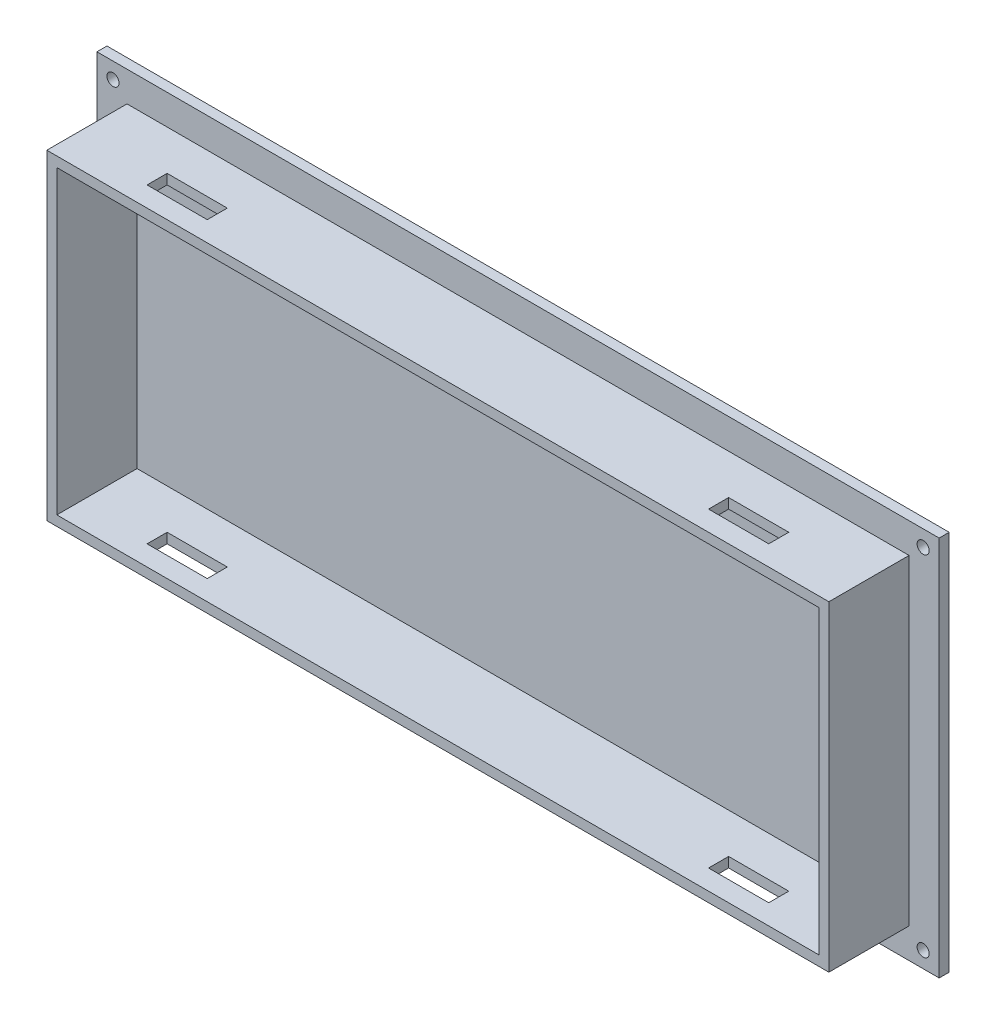
ISO-10303-21;
HEADER;
FILE_DESCRIPTION(('STEP AP214'),'2;1');
FILE_NAME('part.step','',(''),(''),'','','');
FILE_SCHEMA(('AUTOMOTIVE_DESIGN { 1 0 10303 214 1 1 1 1 }'));
ENDSEC;
DATA;
#1=APPLICATION_CONTEXT('core data for automotive mechanical design processes');
#2=APPLICATION_PROTOCOL_DEFINITION('international standard','automotive_design',2000,#1);
#3=PRODUCT_CONTEXT('',#1,'mechanical');
#4=PRODUCT('Part','Part','',(#3));
#5=PRODUCT_RELATED_PRODUCT_CATEGORY('part','',(#4));
#6=PRODUCT_DEFINITION_FORMATION('','',#4);
#7=PRODUCT_DEFINITION_CONTEXT('part definition',#1,'design');
#8=PRODUCT_DEFINITION('design','',#6,#7);
#9=PRODUCT_DEFINITION_SHAPE('','',#8);
#10=(LENGTH_UNIT() NAMED_UNIT(*) SI_UNIT(.MILLI.,.METRE.));
#11=(NAMED_UNIT(*) PLANE_ANGLE_UNIT() SI_UNIT($,.RADIAN.));
#12=(NAMED_UNIT(*) SI_UNIT($,.STERADIAN.) SOLID_ANGLE_UNIT());
#13=UNCERTAINTY_MEASURE_WITH_UNIT(LENGTH_MEASURE(1.E-05),#10,'distance_accuracy_value','');
#14=(GEOMETRIC_REPRESENTATION_CONTEXT(3) GLOBAL_UNCERTAINTY_ASSIGNED_CONTEXT((#13)) GLOBAL_UNIT_ASSIGNED_CONTEXT((#10,
#11,#12)) REPRESENTATION_CONTEXT('',''));
#15=CARTESIAN_POINT('',(0.,0.,0.));
#16=DIRECTION('',(0.,0.,1.));
#17=DIRECTION('',(1.,0.,0.));
#18=AXIS2_PLACEMENT_3D('',#15,#16,#17);
#19=CARTESIAN_POINT('',(0.,0.,2.5));
#20=DIRECTION('',(0.,0.,-1.));
#21=DIRECTION('',(-1.,0.,0.));
#22=AXIS2_PLACEMENT_3D('',#19,#20,#21);
#23=PLANE('',#22);
#24=CARTESIAN_POINT('',(4.,4.,2.5));
#25=DIRECTION('',(0.,0.,1.));
#26=DIRECTION('',(1.,0.,0.));
#27=AXIS2_PLACEMENT_3D('',#24,#25,#26);
#28=CIRCLE('',#27,1.5);
#29=CARTESIAN_POINT('',(5.5,4.,2.5));
#30=VERTEX_POINT('',#29);
#31=EDGE_CURVE('E820',#30,#30,#28,.T.);
#32=ORIENTED_EDGE('',*,*,#31,.F.);
#33=EDGE_LOOP('',(#32));
#34=FACE_BOUND('',#33,.T.);
#35=CARTESIAN_POINT('',(206.,4.,2.5));
#36=DIRECTION('',(0.,0.,1.));
#37=DIRECTION('',(1.,0.,0.));
#38=AXIS2_PLACEMENT_3D('',#35,#36,#37);
#39=CIRCLE('',#38,1.5);
#40=CARTESIAN_POINT('',(207.5,4.,2.5));
#41=VERTEX_POINT('',#40);
#42=EDGE_CURVE('E824',#41,#41,#39,.T.);
#43=ORIENTED_EDGE('',*,*,#42,.F.);
#44=EDGE_LOOP('',(#43));
#45=FACE_BOUND('',#44,.T.);
#46=CARTESIAN_POINT('',(206.,91.,2.5));
#47=DIRECTION('',(0.,0.,1.));
#48=DIRECTION('',(1.,0.,0.));
#49=AXIS2_PLACEMENT_3D('',#46,#47,#48);
#50=CIRCLE('',#49,1.5);
#51=CARTESIAN_POINT('',(207.5,91.,2.5));
#52=VERTEX_POINT('',#51);
#53=EDGE_CURVE('E843',#52,#52,#50,.T.);
#54=ORIENTED_EDGE('',*,*,#53,.F.);
#55=EDGE_LOOP('',(#54));
#56=FACE_BOUND('',#55,.T.);
#57=CARTESIAN_POINT('',(4.,91.,2.5));
#58=DIRECTION('',(0.,0.,1.));
#59=DIRECTION('',(1.,0.,0.));
#60=AXIS2_PLACEMENT_3D('',#57,#58,#59);
#61=CIRCLE('',#60,1.5);
#62=CARTESIAN_POINT('',(5.50000000000001,91.,2.5));
#63=VERTEX_POINT('',#62);
#64=EDGE_CURVE('E832',#63,#63,#61,.T.);
#65=ORIENTED_EDGE('',*,*,#64,.F.);
#66=EDGE_LOOP('',(#65));
#67=FACE_BOUND('',#66,.T.);
#68=DIRECTION('',(0.,-1.,0.));
#69=VECTOR('',#68,1.);
#70=CARTESIAN_POINT('',(0.,0.,2.5));
#71=LINE('',#70,#69);
#72=CARTESIAN_POINT('',(0.,95.,2.5));
#73=VERTEX_POINT('',#72);
#74=CARTESIAN_POINT('',(0.,0.,2.5));
#75=VERTEX_POINT('',#74);
#76=EDGE_CURVE('E381',#73,#75,#71,.T.);
#77=ORIENTED_EDGE('',*,*,#76,.T.);
#78=DIRECTION('',(1.,0.,0.));
#79=VECTOR('',#78,1.);
#80=CARTESIAN_POINT('',(0.,0.,2.5));
#81=LINE('',#80,#79);
#82=CARTESIAN_POINT('',(210.,0.,2.5));
#83=VERTEX_POINT('',#82);
#84=EDGE_CURVE('E384',#75,#83,#81,.T.);
#85=ORIENTED_EDGE('',*,*,#84,.T.);
#86=DIRECTION('',(0.,1.,0.));
#87=VECTOR('',#86,1.);
#88=CARTESIAN_POINT('',(210.,0.,2.5));
#89=LINE('',#88,#87);
#90=CARTESIAN_POINT('',(210.,95.,2.5));
#91=VERTEX_POINT('',#90);
#92=EDGE_CURVE('E387',#83,#91,#89,.T.);
#93=ORIENTED_EDGE('',*,*,#92,.T.);
#94=DIRECTION('',(-1.,0.,0.));
#95=VECTOR('',#94,1.);
#96=CARTESIAN_POINT('',(0.,95.,2.5));
#97=LINE('',#96,#95);
#98=EDGE_CURVE('E389',#91,#73,#97,.T.);
#99=ORIENTED_EDGE('',*,*,#98,.T.);
#100=EDGE_LOOP('',(#77,#85,#93,#99));
#101=FACE_BOUND('',#100,.T.);
#102=DIRECTION('',(0.,-1.,0.));
#103=VECTOR('',#102,1.);
#104=CARTESIAN_POINT('',(7.5,87.5,2.5));
#105=LINE('',#104,#103);
#106=CARTESIAN_POINT('',(7.5,87.5,2.5));
#107=VERTEX_POINT('',#106);
#108=CARTESIAN_POINT('',(7.50000000000001,7.5,2.5));
#109=VERTEX_POINT('',#108);
#110=EDGE_CURVE('E341',#107,#109,#105,.T.);
#111=ORIENTED_EDGE('',*,*,#110,.F.);
#112=DIRECTION('',(-1.,0.,0.));
#113=VECTOR('',#112,1.);
#114=CARTESIAN_POINT('',(7.5,87.5,2.5));
#115=LINE('',#114,#113);
#116=CARTESIAN_POINT('',(202.5,87.5,2.5));
#117=VERTEX_POINT('',#116);
#118=EDGE_CURVE('E352',#117,#107,#115,.T.);
#119=ORIENTED_EDGE('',*,*,#118,.F.);
#120=DIRECTION('',(0.,1.,0.));
#121=VECTOR('',#120,1.);
#122=CARTESIAN_POINT('',(202.5,87.5,2.5));
#123=LINE('',#122,#121);
#124=CARTESIAN_POINT('',(202.5,7.50000000000001,2.5));
#125=VERTEX_POINT('',#124);
#126=EDGE_CURVE('E364',#125,#117,#123,.T.);
#127=ORIENTED_EDGE('',*,*,#126,.F.);
#128=DIRECTION('',(1.,0.,0.));
#129=VECTOR('',#128,1.);
#130=CARTESIAN_POINT('',(7.50000000000001,7.5,2.5));
#131=LINE('',#130,#129);
#132=EDGE_CURVE('E361',#109,#125,#131,.T.);
#133=ORIENTED_EDGE('',*,*,#132,.F.);
#134=EDGE_LOOP('',(#111,#119,#127,#133));
#135=FACE_BOUND('',#134,.T.);
#136=ADVANCED_FACE('F32',(#34,#45,#56,#67,#101,#135),#23,.F.);
#137=CARTESIAN_POINT('',(0.,0.,2.5));
#138=DIRECTION('',(1.,0.,0.));
#139=DIRECTION('',(0.,0.,-1.));
#140=AXIS2_PLACEMENT_3D('',#137,#138,#139);
#141=PLANE('',#140);
#142=DIRECTION('',(0.,-1.,0.));
#143=VECTOR('',#142,1.);
#144=CARTESIAN_POINT('',(0.,0.,0.));
#145=LINE('',#144,#143);
#146=CARTESIAN_POINT('',(0.,95.,0.));
#147=VERTEX_POINT('',#146);
#148=CARTESIAN_POINT('',(0.,0.,0.));
#149=VERTEX_POINT('',#148);
#150=EDGE_CURVE('E380',#147,#149,#145,.T.);
#151=ORIENTED_EDGE('',*,*,#150,.T.);
#152=DIRECTION('',(0.,0.,-1.));
#153=VECTOR('',#152,1.);
#154=CARTESIAN_POINT('',(0.,0.,2.5));
#155=LINE('',#154,#153);
#156=EDGE_CURVE('E407',#75,#149,#155,.T.);
#157=ORIENTED_EDGE('',*,*,#156,.F.);
#158=ORIENTED_EDGE('',*,*,#76,.F.);
#159=DIRECTION('',(0.,0.,-1.));
#160=VECTOR('',#159,1.);
#161=CARTESIAN_POINT('',(0.,95.,2.5));
#162=LINE('',#161,#160);
#163=EDGE_CURVE('E391',#73,#147,#162,.T.);
#164=ORIENTED_EDGE('',*,*,#163,.T.);
#165=EDGE_LOOP('',(#151,#157,#158,#164));
#166=FACE_BOUND('',#165,.T.);
#167=ADVANCED_FACE('F34',(#166),#141,.F.);
#168=CARTESIAN_POINT('',(0.,0.,2.5));
#169=DIRECTION('',(0.,1.,0.));
#170=DIRECTION('',(0.,0.,1.));
#171=AXIS2_PLACEMENT_3D('',#168,#169,#170);
#172=PLANE('',#171);
#173=DIRECTION('',(1.,0.,0.));
#174=VECTOR('',#173,1.);
#175=CARTESIAN_POINT('',(0.,0.,0.));
#176=LINE('',#175,#174);
#177=CARTESIAN_POINT('',(210.,0.,0.));
#178=VERTEX_POINT('',#177);
#179=EDGE_CURVE('E394',#149,#178,#176,.T.);
#180=ORIENTED_EDGE('',*,*,#179,.T.);
#181=DIRECTION('',(0.,0.,-1.));
#182=VECTOR('',#181,1.);
#183=CARTESIAN_POINT('',(210.,0.,2.5));
#184=LINE('',#183,#182);
#185=EDGE_CURVE('E404',#83,#178,#184,.T.);
#186=ORIENTED_EDGE('',*,*,#185,.F.);
#187=ORIENTED_EDGE('',*,*,#84,.F.);
#188=ORIENTED_EDGE('',*,*,#156,.T.);
#189=EDGE_LOOP('',(#180,#186,#187,#188));
#190=FACE_BOUND('',#189,.T.);
#191=ADVANCED_FACE('F488',(#190),#172,.F.);
#192=CARTESIAN_POINT('',(210.,0.,2.5));
#193=DIRECTION('',(-1.,0.,0.));
#194=DIRECTION('',(0.,0.,1.));
#195=AXIS2_PLACEMENT_3D('',#192,#193,#194);
#196=PLANE('',#195);
#197=DIRECTION('',(0.,1.,0.));
#198=VECTOR('',#197,1.);
#199=CARTESIAN_POINT('',(210.,0.,0.));
#200=LINE('',#199,#198);
#201=CARTESIAN_POINT('',(210.,95.,0.));
#202=VERTEX_POINT('',#201);
#203=EDGE_CURVE('E396',#178,#202,#200,.T.);
#204=ORIENTED_EDGE('',*,*,#203,.T.);
#205=DIRECTION('',(0.,0.,-1.));
#206=VECTOR('',#205,1.);
#207=CARTESIAN_POINT('',(210.,95.,2.5));
#208=LINE('',#207,#206);
#209=EDGE_CURVE('E401',#91,#202,#208,.T.);
#210=ORIENTED_EDGE('',*,*,#209,.F.);
#211=ORIENTED_EDGE('',*,*,#92,.F.);
#212=ORIENTED_EDGE('',*,*,#185,.T.);
#213=EDGE_LOOP('',(#204,#210,#211,#212));
#214=FACE_BOUND('',#213,.T.);
#215=ADVANCED_FACE('F503',(#214),#196,.F.);
#216=CARTESIAN_POINT('',(0.,95.,2.5));
#217=DIRECTION('',(0.,-1.,0.));
#218=DIRECTION('',(0.,0.,-1.));
#219=AXIS2_PLACEMENT_3D('',#216,#217,#218);
#220=PLANE('',#219);
#221=DIRECTION('',(-1.,0.,0.));
#222=VECTOR('',#221,1.);
#223=CARTESIAN_POINT('',(0.,95.,0.));
#224=LINE('',#223,#222);
#225=EDGE_CURVE('E385',#202,#147,#224,.T.);
#226=ORIENTED_EDGE('',*,*,#225,.T.);
#227=ORIENTED_EDGE('',*,*,#163,.F.);
#228=ORIENTED_EDGE('',*,*,#98,.F.);
#229=ORIENTED_EDGE('',*,*,#209,.T.);
#230=EDGE_LOOP('',(#226,#227,#228,#229));
#231=FACE_BOUND('',#230,.T.);
#232=ADVANCED_FACE('F499',(#231),#220,.F.);
#233=CARTESIAN_POINT('',(0.,0.,0.));
#234=DIRECTION('',(0.,0.,-1.));
#235=DIRECTION('',(-1.,0.,0.));
#236=AXIS2_PLACEMENT_3D('',#233,#234,#235);
#237=PLANE('',#236);
#238=CARTESIAN_POINT('',(4.,4.,0.));
#239=DIRECTION('',(0.,0.,-1.));
#240=DIRECTION('',(-1.,0.,0.));
#241=AXIS2_PLACEMENT_3D('',#238,#239,#240);
#242=CIRCLE('',#241,1.5);
#243=CARTESIAN_POINT('',(2.5,4.,0.));
#244=VERTEX_POINT('',#243);
#245=EDGE_CURVE('E823',#244,#244,#242,.F.);
#246=ORIENTED_EDGE('',*,*,#245,.T.);
#247=EDGE_LOOP('',(#246));
#248=FACE_BOUND('',#247,.T.);
#249=CARTESIAN_POINT('',(206.,4.,0.));
#250=DIRECTION('',(0.,0.,-1.));
#251=DIRECTION('',(-1.,0.,0.));
#252=AXIS2_PLACEMENT_3D('',#249,#250,#251);
#253=CIRCLE('',#252,1.5);
#254=CARTESIAN_POINT('',(204.5,4.,0.));
#255=VERTEX_POINT('',#254);
#256=EDGE_CURVE('E827',#255,#255,#253,.F.);
#257=ORIENTED_EDGE('',*,*,#256,.T.);
#258=EDGE_LOOP('',(#257));
#259=FACE_BOUND('',#258,.T.);
#260=CARTESIAN_POINT('',(206.,91.,0.));
#261=DIRECTION('',(0.,0.,-1.));
#262=DIRECTION('',(-1.,0.,0.));
#263=AXIS2_PLACEMENT_3D('',#260,#261,#262);
#264=CIRCLE('',#263,1.5);
#265=CARTESIAN_POINT('',(204.5,91.,0.));
#266=VERTEX_POINT('',#265);
#267=EDGE_CURVE('E835',#266,#266,#264,.F.);
#268=ORIENTED_EDGE('',*,*,#267,.T.);
#269=EDGE_LOOP('',(#268));
#270=FACE_BOUND('',#269,.T.);
#271=CARTESIAN_POINT('',(4.,91.,0.));
#272=DIRECTION('',(0.,0.,-1.));
#273=DIRECTION('',(-1.,0.,0.));
#274=AXIS2_PLACEMENT_3D('',#271,#272,#273);
#275=CIRCLE('',#274,1.5);
#276=CARTESIAN_POINT('',(2.5,91.,0.));
#277=VERTEX_POINT('',#276);
#278=EDGE_CURVE('E273',#277,#277,#275,.F.);
#279=ORIENTED_EDGE('',*,*,#278,.T.);
#280=EDGE_LOOP('',(#279));
#281=FACE_BOUND('',#280,.T.);
#282=ORIENTED_EDGE('',*,*,#150,.F.);
#283=ORIENTED_EDGE('',*,*,#225,.F.);
#284=ORIENTED_EDGE('',*,*,#203,.F.);
#285=ORIENTED_EDGE('',*,*,#179,.F.);
#286=EDGE_LOOP('',(#282,#283,#284,#285));
#287=FACE_BOUND('',#286,.T.);
#288=ADVANCED_FACE('F496',(#248,#259,#270,#281,#287),#237,.T.);
#289=CARTESIAN_POINT('',(7.5,87.5,22.5));
#290=DIRECTION('',(1.,0.,0.));
#291=DIRECTION('',(0.,1.,0.));
#292=AXIS2_PLACEMENT_3D('',#289,#290,#291);
#293=PLANE('',#292);
#294=ORIENTED_EDGE('',*,*,#110,.T.);
#295=DIRECTION('',(0.,0.,-1.));
#296=VECTOR('',#295,1.);
#297=CARTESIAN_POINT('',(7.50000000000001,7.5,22.5));
#298=LINE('',#297,#296);
#299=CARTESIAN_POINT('',(7.50000000000001,7.5,22.5));
#300=VERTEX_POINT('',#299);
#301=EDGE_CURVE('E377',#300,#109,#298,.T.);
#302=ORIENTED_EDGE('',*,*,#301,.F.);
#303=DIRECTION('',(0.,-1.,0.));
#304=VECTOR('',#303,1.);
#305=CARTESIAN_POINT('',(7.5,87.5,22.5));
#306=LINE('',#305,#304);
#307=CARTESIAN_POINT('',(7.5,87.5,22.5));
#308=VERTEX_POINT('',#307);
#309=EDGE_CURVE('E348',#308,#300,#306,.T.);
#310=ORIENTED_EDGE('',*,*,#309,.F.);
#311=DIRECTION('',(0.,0.,-1.));
#312=VECTOR('',#311,1.);
#313=CARTESIAN_POINT('',(7.5,87.5,22.5));
#314=LINE('',#313,#312);
#315=EDGE_CURVE('E358',#308,#107,#314,.T.);
#316=ORIENTED_EDGE('',*,*,#315,.T.);
#317=EDGE_LOOP('',(#294,#302,#310,#316));
#318=FACE_BOUND('',#317,.T.);
#319=ADVANCED_FACE('F494',(#318),#293,.F.);
#320=CARTESIAN_POINT('',(7.50000000000001,7.5,22.5));
#321=DIRECTION('',(0.,1.,0.));
#322=DIRECTION('',(-1.,0.,0.));
#323=AXIS2_PLACEMENT_3D('',#320,#321,#322);
#324=PLANE('',#323);
#325=DIRECTION('',(-1.,0.,0.));
#326=VECTOR('',#325,1.);
#327=CARTESIAN_POINT('',(182.5,7.50000000000001,17.5));
#328=LINE('',#327,#326);
#329=CARTESIAN_POINT('',(182.5,7.50000000000001,17.5));
#330=VERTEX_POINT('',#329);
#331=CARTESIAN_POINT('',(167.5,7.50000000000001,17.5));
#332=VERTEX_POINT('',#331);
#333=EDGE_CURVE('E443',#330,#332,#328,.T.);
#334=ORIENTED_EDGE('',*,*,#333,.F.);
#335=DIRECTION('',(0.,0.,1.));
#336=VECTOR('',#335,1.);
#337=CARTESIAN_POINT('',(182.5,7.50000000000001,17.5));
#338=LINE('',#337,#336);
#339=CARTESIAN_POINT('',(182.5,7.50000000000001,12.5));
#340=VERTEX_POINT('',#339);
#341=EDGE_CURVE('E261',#340,#330,#338,.T.);
#342=ORIENTED_EDGE('',*,*,#341,.F.);
#343=DIRECTION('',(1.,0.,0.));
#344=VECTOR('',#343,1.);
#345=CARTESIAN_POINT('',(182.5,7.50000000000001,12.5));
#346=LINE('',#345,#344);
#347=CARTESIAN_POINT('',(167.5,7.50000000000001,12.5));
#348=VERTEX_POINT('',#347);
#349=EDGE_CURVE('E258',#348,#340,#346,.T.);
#350=ORIENTED_EDGE('',*,*,#349,.F.);
#351=DIRECTION('',(0.,0.,-1.));
#352=VECTOR('',#351,1.);
#353=CARTESIAN_POINT('',(167.5,7.50000000000001,17.5));
#354=LINE('',#353,#352);
#355=EDGE_CURVE('E251',#332,#348,#354,.T.);
#356=ORIENTED_EDGE('',*,*,#355,.F.);
#357=EDGE_LOOP('',(#334,#342,#350,#356));
#358=FACE_BOUND('',#357,.T.);
#359=DIRECTION('',(-1.,0.,0.));
#360=VECTOR('',#359,1.);
#361=CARTESIAN_POINT('',(42.5,7.5,17.5));
#362=LINE('',#361,#360);
#363=CARTESIAN_POINT('',(42.5,7.5,17.5));
#364=VERTEX_POINT('',#363);
#365=CARTESIAN_POINT('',(27.5,7.5,17.5));
#366=VERTEX_POINT('',#365);
#367=EDGE_CURVE('E264',#364,#366,#362,.T.);
#368=ORIENTED_EDGE('',*,*,#367,.F.);
#369=DIRECTION('',(0.,0.,1.));
#370=VECTOR('',#369,1.);
#371=CARTESIAN_POINT('',(42.5,7.5,12.5));
#372=LINE('',#371,#370);
#373=CARTESIAN_POINT('',(42.5,7.5,12.5));
#374=VERTEX_POINT('',#373);
#375=EDGE_CURVE('E267',#374,#364,#372,.T.);
#376=ORIENTED_EDGE('',*,*,#375,.F.);
#377=DIRECTION('',(1.,0.,0.));
#378=VECTOR('',#377,1.);
#379=CARTESIAN_POINT('',(42.5,7.5,12.5));
#380=LINE('',#379,#378);
#381=CARTESIAN_POINT('',(27.5,7.5,12.5));
#382=VERTEX_POINT('',#381);
#383=EDGE_CURVE('E269',#382,#374,#380,.T.);
#384=ORIENTED_EDGE('',*,*,#383,.F.);
#385=DIRECTION('',(0.,0.,-1.));
#386=VECTOR('',#385,1.);
#387=CARTESIAN_POINT('',(27.5,7.5,12.5));
#388=LINE('',#387,#386);
#389=EDGE_CURVE('E262',#366,#382,#388,.T.);
#390=ORIENTED_EDGE('',*,*,#389,.F.);
#391=EDGE_LOOP('',(#368,#376,#384,#390));
#392=FACE_BOUND('',#391,.T.);
#393=ORIENTED_EDGE('',*,*,#132,.T.);
#394=DIRECTION('',(0.,0.,-1.));
#395=VECTOR('',#394,1.);
#396=CARTESIAN_POINT('',(202.5,7.50000000000001,22.5));
#397=LINE('',#396,#395);
#398=CARTESIAN_POINT('',(202.5,7.50000000000001,22.5));
#399=VERTEX_POINT('',#398);
#400=EDGE_CURVE('E374',#399,#125,#397,.T.);
#401=ORIENTED_EDGE('',*,*,#400,.F.);
#402=DIRECTION('',(1.,0.,0.));
#403=VECTOR('',#402,1.);
#404=CARTESIAN_POINT('',(7.50000000000001,7.5,22.5));
#405=LINE('',#404,#403);
#406=EDGE_CURVE('E351',#300,#399,#405,.T.);
#407=ORIENTED_EDGE('',*,*,#406,.F.);
#408=ORIENTED_EDGE('',*,*,#301,.T.);
#409=EDGE_LOOP('',(#393,#401,#407,#408));
#410=FACE_BOUND('',#409,.T.);
#411=ADVANCED_FACE('F536',(#358,#392,#410),#324,.F.);
#412=CARTESIAN_POINT('',(202.5,87.5,22.5));
#413=DIRECTION('',(-1.,0.,0.));
#414=DIRECTION('',(0.,0.,1.));
#415=AXIS2_PLACEMENT_3D('',#412,#413,#414);
#416=PLANE('',#415);
#417=ORIENTED_EDGE('',*,*,#126,.T.);
#418=DIRECTION('',(0.,0.,-1.));
#419=VECTOR('',#418,1.);
#420=CARTESIAN_POINT('',(202.5,87.5,22.5));
#421=LINE('',#420,#419);
#422=CARTESIAN_POINT('',(202.5,87.5,22.5));
#423=VERTEX_POINT('',#422);
#424=EDGE_CURVE('E371',#423,#117,#421,.T.);
#425=ORIENTED_EDGE('',*,*,#424,.F.);
#426=DIRECTION('',(0.,1.,0.));
#427=VECTOR('',#426,1.);
#428=CARTESIAN_POINT('',(202.5,87.5,22.5));
#429=LINE('',#428,#427);
#430=EDGE_CURVE('E354',#399,#423,#429,.T.);
#431=ORIENTED_EDGE('',*,*,#430,.F.);
#432=ORIENTED_EDGE('',*,*,#400,.T.);
#433=EDGE_LOOP('',(#417,#425,#431,#432));
#434=FACE_BOUND('',#433,.T.);
#435=ADVANCED_FACE('F534',(#434),#416,.F.);
#436=CARTESIAN_POINT('',(7.5,87.5,22.5));
#437=DIRECTION('',(0.,-1.,0.));
#438=DIRECTION('',(0.,0.,-1.));
#439=AXIS2_PLACEMENT_3D('',#436,#437,#438);
#440=PLANE('',#439);
#441=DIRECTION('',(-1.,0.,0.));
#442=VECTOR('',#441,1.);
#443=CARTESIAN_POINT('',(182.5,87.5,12.5));
#444=LINE('',#443,#442);
#445=CARTESIAN_POINT('',(182.5,87.5,12.5));
#446=VERTEX_POINT('',#445);
#447=CARTESIAN_POINT('',(167.5,87.5,12.5));
#448=VERTEX_POINT('',#447);
#449=EDGE_CURVE('E232',#446,#448,#444,.T.);
#450=ORIENTED_EDGE('',*,*,#449,.F.);
#451=DIRECTION('',(0.,0.,-1.));
#452=VECTOR('',#451,1.);
#453=CARTESIAN_POINT('',(182.5,87.5,17.5));
#454=LINE('',#453,#452);
#455=CARTESIAN_POINT('',(182.5,87.5,17.5));
#456=VERTEX_POINT('',#455);
#457=EDGE_CURVE('E238',#456,#446,#454,.T.);
#458=ORIENTED_EDGE('',*,*,#457,.F.);
#459=DIRECTION('',(1.,0.,0.));
#460=VECTOR('',#459,1.);
#461=CARTESIAN_POINT('',(182.5,87.5,17.5));
#462=LINE('',#461,#460);
#463=CARTESIAN_POINT('',(167.5,87.5,17.5));
#464=VERTEX_POINT('',#463);
#465=EDGE_CURVE('E243',#464,#456,#462,.T.);
#466=ORIENTED_EDGE('',*,*,#465,.F.);
#467=DIRECTION('',(0.,0.,1.));
#468=VECTOR('',#467,1.);
#469=CARTESIAN_POINT('',(167.5,87.5,17.5));
#470=LINE('',#469,#468);
#471=EDGE_CURVE('E222',#448,#464,#470,.T.);
#472=ORIENTED_EDGE('',*,*,#471,.F.);
#473=EDGE_LOOP('',(#450,#458,#466,#472));
#474=FACE_BOUND('',#473,.T.);
#475=DIRECTION('',(-1.,0.,0.));
#476=VECTOR('',#475,1.);
#477=CARTESIAN_POINT('',(42.5,87.5,12.5));
#478=LINE('',#477,#476);
#479=CARTESIAN_POINT('',(42.5,87.5,12.5));
#480=VERTEX_POINT('',#479);
#481=CARTESIAN_POINT('',(27.5,87.5,12.5));
#482=VERTEX_POINT('',#481);
#483=EDGE_CURVE('E272',#480,#482,#478,.T.);
#484=ORIENTED_EDGE('',*,*,#483,.F.);
#485=DIRECTION('',(0.,0.,-1.));
#486=VECTOR('',#485,1.);
#487=CARTESIAN_POINT('',(42.5,87.5,12.5));
#488=LINE('',#487,#486);
#489=CARTESIAN_POINT('',(42.5,87.5,17.5));
#490=VERTEX_POINT('',#489);
#491=EDGE_CURVE('E270',#490,#480,#488,.T.);
#492=ORIENTED_EDGE('',*,*,#491,.F.);
#493=DIRECTION('',(1.,0.,0.));
#494=VECTOR('',#493,1.);
#495=CARTESIAN_POINT('',(42.5,87.5,17.5));
#496=LINE('',#495,#494);
#497=CARTESIAN_POINT('',(27.5,87.5,17.5));
#498=VERTEX_POINT('',#497);
#499=EDGE_CURVE('E279',#498,#490,#496,.T.);
#500=ORIENTED_EDGE('',*,*,#499,.F.);
#501=DIRECTION('',(0.,0.,1.));
#502=VECTOR('',#501,1.);
#503=CARTESIAN_POINT('',(27.5,87.5,12.5));
#504=LINE('',#503,#502);
#505=EDGE_CURVE('E276',#482,#498,#504,.T.);
#506=ORIENTED_EDGE('',*,*,#505,.F.);
#507=EDGE_LOOP('',(#484,#492,#500,#506));
#508=FACE_BOUND('',#507,.T.);
#509=ORIENTED_EDGE('',*,*,#118,.T.);
#510=ORIENTED_EDGE('',*,*,#315,.F.);
#511=DIRECTION('',(-1.,0.,0.));
#512=VECTOR('',#511,1.);
#513=CARTESIAN_POINT('',(7.5,87.5,22.5));
#514=LINE('',#513,#512);
#515=EDGE_CURVE('E356',#423,#308,#514,.T.);
#516=ORIENTED_EDGE('',*,*,#515,.F.);
#517=ORIENTED_EDGE('',*,*,#424,.T.);
#518=EDGE_LOOP('',(#509,#510,#516,#517));
#519=FACE_BOUND('',#518,.T.);
#520=ADVANCED_FACE('F240',(#474,#508,#519),#440,.F.);
#521=CARTESIAN_POINT('',(0.,0.,22.5));
#522=DIRECTION('',(0.,0.,1.));
#523=DIRECTION('',(1.,0.,0.));
#524=AXIS2_PLACEMENT_3D('',#521,#522,#523);
#525=PLANE('',#524);
#526=DIRECTION('',(0.,-1.,0.));
#527=VECTOR('',#526,1.);
#528=CARTESIAN_POINT('',(10.,85.,22.5));
#529=LINE('',#528,#527);
#530=CARTESIAN_POINT('',(10.,85.,22.5));
#531=VERTEX_POINT('',#530);
#532=CARTESIAN_POINT('',(10.,9.99999999999997,22.5));
#533=VERTEX_POINT('',#532);
#534=EDGE_CURVE('E315',#531,#533,#529,.T.);
#535=ORIENTED_EDGE('',*,*,#534,.F.);
#536=DIRECTION('',(-1.,0.,0.));
#537=VECTOR('',#536,1.);
#538=CARTESIAN_POINT('',(10.,85.,22.5));
#539=LINE('',#538,#537);
#540=CARTESIAN_POINT('',(200.,85.,22.5));
#541=VERTEX_POINT('',#540);
#542=EDGE_CURVE('E320',#541,#531,#539,.T.);
#543=ORIENTED_EDGE('',*,*,#542,.F.);
#544=DIRECTION('',(0.,1.,0.));
#545=VECTOR('',#544,1.);
#546=CARTESIAN_POINT('',(200.,85.,22.5));
#547=LINE('',#546,#545);
#548=CARTESIAN_POINT('',(200.,9.99999999999997,22.5));
#549=VERTEX_POINT('',#548);
#550=EDGE_CURVE('E334',#549,#541,#547,.T.);
#551=ORIENTED_EDGE('',*,*,#550,.F.);
#552=DIRECTION('',(1.,0.,0.));
#553=VECTOR('',#552,1.);
#554=CARTESIAN_POINT('',(10.,9.99999999999997,22.5));
#555=LINE('',#554,#553);
#556=EDGE_CURVE('E331',#533,#549,#555,.T.);
#557=ORIENTED_EDGE('',*,*,#556,.F.);
#558=EDGE_LOOP('',(#535,#543,#551,#557));
#559=FACE_BOUND('',#558,.T.);
#560=ORIENTED_EDGE('',*,*,#309,.T.);
#561=ORIENTED_EDGE('',*,*,#406,.T.);
#562=ORIENTED_EDGE('',*,*,#430,.T.);
#563=ORIENTED_EDGE('',*,*,#515,.T.);
#564=EDGE_LOOP('',(#560,#561,#562,#563));
#565=FACE_BOUND('',#564,.T.);
#566=ADVANCED_FACE('F467',(#559,#565),#525,.T.);
#567=CARTESIAN_POINT('',(10.,85.,2.5));
#568=DIRECTION('',(-1.,0.,0.));
#569=DIRECTION('',(0.,-1.,0.));
#570=AXIS2_PLACEMENT_3D('',#567,#568,#569);
#571=PLANE('',#570);
#572=ORIENTED_EDGE('',*,*,#534,.T.);
#573=DIRECTION('',(0.,0.,1.));
#574=VECTOR('',#573,1.);
#575=CARTESIAN_POINT('',(10.,9.99999999999997,2.5));
#576=LINE('',#575,#574);
#577=CARTESIAN_POINT('',(10.,9.99999999999997,2.5));
#578=VERTEX_POINT('',#577);
#579=EDGE_CURVE('E329',#578,#533,#576,.T.);
#580=ORIENTED_EDGE('',*,*,#579,.F.);
#581=DIRECTION('',(0.,-1.,0.));
#582=VECTOR('',#581,1.);
#583=CARTESIAN_POINT('',(10.,85.,2.5));
#584=LINE('',#583,#582);
#585=CARTESIAN_POINT('',(10.,85.,2.5));
#586=VERTEX_POINT('',#585);
#587=EDGE_CURVE('E316',#586,#578,#584,.T.);
#588=ORIENTED_EDGE('',*,*,#587,.F.);
#589=DIRECTION('',(0.,0.,1.));
#590=VECTOR('',#589,1.);
#591=CARTESIAN_POINT('',(10.,85.,2.5));
#592=LINE('',#591,#590);
#593=EDGE_CURVE('E339',#586,#531,#592,.T.);
#594=ORIENTED_EDGE('',*,*,#593,.T.);
#595=EDGE_LOOP('',(#572,#580,#588,#594));
#596=FACE_BOUND('',#595,.T.);
#597=ADVANCED_FACE('F457',(#596),#571,.F.);
#598=CARTESIAN_POINT('',(10.,85.,2.5));
#599=DIRECTION('',(0.,1.,0.));
#600=DIRECTION('',(0.,0.,1.));
#601=AXIS2_PLACEMENT_3D('',#598,#599,#600);
#602=PLANE('',#601);
#603=DIRECTION('',(1.,0.,0.));
#604=VECTOR('',#603,1.);
#605=CARTESIAN_POINT('',(10.,85.,17.5));
#606=LINE('',#605,#604);
#607=CARTESIAN_POINT('',(167.5,85.,17.5));
#608=VERTEX_POINT('',#607);
#609=CARTESIAN_POINT('',(182.5,85.,17.5));
#610=VERTEX_POINT('',#609);
#611=EDGE_CURVE('E309',#608,#610,#606,.T.);
#612=ORIENTED_EDGE('',*,*,#611,.T.);
#613=DIRECTION('',(0.,0.,-1.));
#614=VECTOR('',#613,1.);
#615=CARTESIAN_POINT('',(182.5,85.,2.49999999999713));
#616=LINE('',#615,#614);
#617=CARTESIAN_POINT('',(182.5,85.,12.5));
#618=VERTEX_POINT('',#617);
#619=EDGE_CURVE('E312',#610,#618,#616,.T.);
#620=ORIENTED_EDGE('',*,*,#619,.T.);
#621=DIRECTION('',(-1.,0.,0.));
#622=VECTOR('',#621,1.);
#623=CARTESIAN_POINT('',(10.,85.,12.5));
#624=LINE('',#623,#622);
#625=CARTESIAN_POINT('',(167.5,85.,12.5));
#626=VERTEX_POINT('',#625);
#627=EDGE_CURVE('E306',#618,#626,#624,.T.);
#628=ORIENTED_EDGE('',*,*,#627,.T.);
#629=DIRECTION('',(0.,0.,1.));
#630=VECTOR('',#629,1.);
#631=CARTESIAN_POINT('',(167.5,85.,2.50000000000087));
#632=LINE('',#631,#630);
#633=EDGE_CURVE('E225',#626,#608,#632,.T.);
#634=ORIENTED_EDGE('',*,*,#633,.T.);
#635=EDGE_LOOP('',(#612,#620,#628,#634));
#636=FACE_BOUND('',#635,.T.);
#637=DIRECTION('',(1.,0.,0.));
#638=VECTOR('',#637,1.);
#639=CARTESIAN_POINT('',(10.,85.,17.5));
#640=LINE('',#639,#638);
#641=CARTESIAN_POINT('',(27.5,85.,17.5));
#642=VERTEX_POINT('',#641);
#643=CARTESIAN_POINT('',(42.5,85.,17.5));
#644=VERTEX_POINT('',#643);
#645=EDGE_CURVE('E300',#642,#644,#640,.T.);
#646=ORIENTED_EDGE('',*,*,#645,.T.);
#647=DIRECTION('',(0.,0.,-1.));
#648=VECTOR('',#647,1.);
#649=CARTESIAN_POINT('',(42.5,85.,2.49999999999995));
#650=LINE('',#649,#648);
#651=CARTESIAN_POINT('',(42.5,85.,12.5));
#652=VERTEX_POINT('',#651);
#653=EDGE_CURVE('E303',#644,#652,#650,.T.);
#654=ORIENTED_EDGE('',*,*,#653,.T.);
#655=DIRECTION('',(-1.,0.,0.));
#656=VECTOR('',#655,1.);
#657=CARTESIAN_POINT('',(10.,85.,12.5));
#658=LINE('',#657,#656);
#659=CARTESIAN_POINT('',(27.5,85.,12.5));
#660=VERTEX_POINT('',#659);
#661=EDGE_CURVE('E260',#652,#660,#658,.T.);
#662=ORIENTED_EDGE('',*,*,#661,.T.);
#663=DIRECTION('',(0.,0.,1.));
#664=VECTOR('',#663,1.);
#665=CARTESIAN_POINT('',(27.5,85.,2.5));
#666=LINE('',#665,#664);
#667=EDGE_CURVE('E297',#660,#642,#666,.T.);
#668=ORIENTED_EDGE('',*,*,#667,.T.);
#669=EDGE_LOOP('',(#646,#654,#662,#668));
#670=FACE_BOUND('',#669,.T.);
#671=ORIENTED_EDGE('',*,*,#542,.T.);
#672=ORIENTED_EDGE('',*,*,#593,.F.);
#673=DIRECTION('',(-1.,0.,0.));
#674=VECTOR('',#673,1.);
#675=CARTESIAN_POINT('',(10.,85.,2.5));
#676=LINE('',#675,#674);
#677=CARTESIAN_POINT('',(200.,85.,2.5));
#678=VERTEX_POINT('',#677);
#679=EDGE_CURVE('E326',#678,#586,#676,.T.);
#680=ORIENTED_EDGE('',*,*,#679,.F.);
#681=DIRECTION('',(0.,0.,1.));
#682=VECTOR('',#681,1.);
#683=CARTESIAN_POINT('',(200.,85.,2.5));
#684=LINE('',#683,#682);
#685=EDGE_CURVE('E342',#678,#541,#684,.T.);
#686=ORIENTED_EDGE('',*,*,#685,.T.);
#687=EDGE_LOOP('',(#671,#672,#680,#686));
#688=FACE_BOUND('',#687,.T.);
#689=ADVANCED_FACE('F453',(#636,#670,#688),#602,.F.);
#690=CARTESIAN_POINT('',(200.,85.,2.5));
#691=DIRECTION('',(1.,0.,0.));
#692=DIRECTION('',(0.,0.,-1.));
#693=AXIS2_PLACEMENT_3D('',#690,#691,#692);
#694=PLANE('',#693);
#695=ORIENTED_EDGE('',*,*,#550,.T.);
#696=ORIENTED_EDGE('',*,*,#685,.F.);
#697=DIRECTION('',(0.,1.,0.));
#698=VECTOR('',#697,1.);
#699=CARTESIAN_POINT('',(200.,85.,2.5));
#700=LINE('',#699,#698);
#701=CARTESIAN_POINT('',(200.,9.99999999999997,2.5));
#702=VERTEX_POINT('',#701);
#703=EDGE_CURVE('E323',#702,#678,#700,.T.);
#704=ORIENTED_EDGE('',*,*,#703,.F.);
#705=DIRECTION('',(0.,0.,1.));
#706=VECTOR('',#705,1.);
#707=CARTESIAN_POINT('',(200.,9.99999999999997,2.5));
#708=LINE('',#707,#706);
#709=EDGE_CURVE('E344',#702,#549,#708,.T.);
#710=ORIENTED_EDGE('',*,*,#709,.T.);
#711=EDGE_LOOP('',(#695,#696,#704,#710));
#712=FACE_BOUND('',#711,.T.);
#713=ADVANCED_FACE('F456',(#712),#694,.F.);
#714=CARTESIAN_POINT('',(10.,9.99999999999997,2.5));
#715=DIRECTION('',(0.,-1.,0.));
#716=DIRECTION('',(0.,0.,-1.));
#717=AXIS2_PLACEMENT_3D('',#714,#715,#716);
#718=PLANE('',#717);
#719=DIRECTION('',(1.,0.,0.));
#720=VECTOR('',#719,1.);
#721=CARTESIAN_POINT('',(10.,9.99999999999997,12.5));
#722=LINE('',#721,#720);
#723=CARTESIAN_POINT('',(167.5,9.99999999999997,12.5));
#724=VERTEX_POINT('',#723);
#725=CARTESIAN_POINT('',(182.5,9.99999999999997,12.5));
#726=VERTEX_POINT('',#725);
#727=EDGE_CURVE('E422',#724,#726,#722,.T.);
#728=ORIENTED_EDGE('',*,*,#727,.T.);
#729=DIRECTION('',(0.,0.,1.));
#730=VECTOR('',#729,1.);
#731=CARTESIAN_POINT('',(182.5,9.99999999999997,2.49999999999713));
#732=LINE('',#731,#730);
#733=CARTESIAN_POINT('',(182.5,9.99999999999997,17.5));
#734=VERTEX_POINT('',#733);
#735=EDGE_CURVE('E11',#726,#734,#732,.T.);
#736=ORIENTED_EDGE('',*,*,#735,.T.);
#737=DIRECTION('',(-1.,0.,0.));
#738=VECTOR('',#737,1.);
#739=CARTESIAN_POINT('',(10.,9.99999999999997,17.5));
#740=LINE('',#739,#738);
#741=CARTESIAN_POINT('',(167.5,9.99999999999997,17.5));
#742=VERTEX_POINT('',#741);
#743=EDGE_CURVE('E40',#734,#742,#740,.T.);
#744=ORIENTED_EDGE('',*,*,#743,.T.);
#745=DIRECTION('',(0.,0.,-1.));
#746=VECTOR('',#745,1.);
#747=CARTESIAN_POINT('',(167.5,9.99999999999997,2.50000000000087));
#748=LINE('',#747,#746);
#749=EDGE_CURVE('E425',#742,#724,#748,.T.);
#750=ORIENTED_EDGE('',*,*,#749,.T.);
#751=EDGE_LOOP('',(#728,#736,#744,#750));
#752=FACE_BOUND('',#751,.T.);
#753=DIRECTION('',(1.,0.,0.));
#754=VECTOR('',#753,1.);
#755=CARTESIAN_POINT('',(10.,9.99999999999997,12.5));
#756=LINE('',#755,#754);
#757=CARTESIAN_POINT('',(27.5,9.99999999999997,12.5));
#758=VERTEX_POINT('',#757);
#759=CARTESIAN_POINT('',(42.5,9.99999999999997,12.5));
#760=VERTEX_POINT('',#759);
#761=EDGE_CURVE('E410',#758,#760,#756,.T.);
#762=ORIENTED_EDGE('',*,*,#761,.T.);
#763=DIRECTION('',(0.,0.,1.));
#764=VECTOR('',#763,1.);
#765=CARTESIAN_POINT('',(42.5,9.99999999999997,2.49999999999995));
#766=LINE('',#765,#764);
#767=CARTESIAN_POINT('',(42.5,9.99999999999997,17.5));
#768=VERTEX_POINT('',#767);
#769=EDGE_CURVE('E419',#760,#768,#766,.T.);
#770=ORIENTED_EDGE('',*,*,#769,.T.);
#771=DIRECTION('',(-1.,0.,0.));
#772=VECTOR('',#771,1.);
#773=CARTESIAN_POINT('',(10.,9.99999999999997,17.5));
#774=LINE('',#773,#772);
#775=CARTESIAN_POINT('',(27.5,9.99999999999997,17.5));
#776=VERTEX_POINT('',#775);
#777=EDGE_CURVE('E416',#768,#776,#774,.T.);
#778=ORIENTED_EDGE('',*,*,#777,.T.);
#779=DIRECTION('',(0.,0.,-1.));
#780=VECTOR('',#779,1.);
#781=CARTESIAN_POINT('',(27.5,9.99999999999997,2.5));
#782=LINE('',#781,#780);
#783=EDGE_CURVE('E413',#776,#758,#782,.T.);
#784=ORIENTED_EDGE('',*,*,#783,.T.);
#785=EDGE_LOOP('',(#762,#770,#778,#784));
#786=FACE_BOUND('',#785,.T.);
#787=ORIENTED_EDGE('',*,*,#556,.T.);
#788=ORIENTED_EDGE('',*,*,#709,.F.);
#789=DIRECTION('',(1.,0.,0.));
#790=VECTOR('',#789,1.);
#791=CARTESIAN_POINT('',(10.,9.99999999999997,2.5));
#792=LINE('',#791,#790);
#793=EDGE_CURVE('E319',#578,#702,#792,.T.);
#794=ORIENTED_EDGE('',*,*,#793,.F.);
#795=ORIENTED_EDGE('',*,*,#579,.T.);
#796=EDGE_LOOP('',(#787,#788,#794,#795));
#797=FACE_BOUND('',#796,.T.);
#798=ADVANCED_FACE('F429',(#752,#786,#797),#718,.F.);
#799=CARTESIAN_POINT('',(0.,0.,2.5));
#800=DIRECTION('',(0.,0.,1.));
#801=DIRECTION('',(1.,0.,0.));
#802=AXIS2_PLACEMENT_3D('',#799,#800,#801);
#803=PLANE('',#802);
#804=ORIENTED_EDGE('',*,*,#587,.T.);
#805=ORIENTED_EDGE('',*,*,#793,.T.);
#806=ORIENTED_EDGE('',*,*,#703,.T.);
#807=ORIENTED_EDGE('',*,*,#679,.T.);
#808=EDGE_LOOP('',(#804,#805,#806,#807));
#809=FACE_BOUND('',#808,.T.);
#810=ADVANCED_FACE('F474',(#809),#803,.T.);
#811=CARTESIAN_POINT('',(42.5,-8.31138830084191,12.5));
#812=DIRECTION('',(0.,0.,-1.));
#813=DIRECTION('',(-1.,0.,0.));
#814=AXIS2_PLACEMENT_3D('',#811,#812,#813);
#815=PLANE('',#814);
#816=DIRECTION('',(0.,1.,0.));
#817=VECTOR('',#816,1.);
#818=CARTESIAN_POINT('',(27.5,-8.31138830084191,12.5));
#819=LINE('',#818,#817);
#820=EDGE_CURVE('E55',#382,#758,#819,.T.);
#821=ORIENTED_EDGE('',*,*,#820,.F.);
#822=ORIENTED_EDGE('',*,*,#383,.T.);
#823=DIRECTION('',(0.,1.,0.));
#824=VECTOR('',#823,1.);
#825=CARTESIAN_POINT('',(42.5,-8.31138830084191,12.5));
#826=LINE('',#825,#824);
#827=EDGE_CURVE('E292',#374,#760,#826,.T.);
#828=ORIENTED_EDGE('',*,*,#827,.T.);
#829=ORIENTED_EDGE('',*,*,#761,.F.);
#830=EDGE_LOOP('',(#821,#822,#828,#829));
#831=FACE_BOUND('',#830,.T.);
#832=ADVANCED_FACE('F575',(#831),#815,.F.);
#833=CARTESIAN_POINT('',(27.5,-8.31138830084191,12.5));
#834=DIRECTION('',(-1.,0.,0.));
#835=DIRECTION('',(0.,-1.,0.));
#836=AXIS2_PLACEMENT_3D('',#833,#834,#835);
#837=PLANE('',#836);
#838=DIRECTION('',(0.,1.,0.));
#839=VECTOR('',#838,1.);
#840=CARTESIAN_POINT('',(27.5,-8.31138830084191,17.5));
#841=LINE('',#840,#839);
#842=EDGE_CURVE('E286',#366,#776,#841,.T.);
#843=ORIENTED_EDGE('',*,*,#842,.F.);
#844=ORIENTED_EDGE('',*,*,#389,.T.);
#845=ORIENTED_EDGE('',*,*,#820,.T.);
#846=ORIENTED_EDGE('',*,*,#783,.F.);
#847=EDGE_LOOP('',(#843,#844,#845,#846));
#848=FACE_BOUND('',#847,.T.);
#849=ADVANCED_FACE('F580',(#848),#837,.F.);
#850=CARTESIAN_POINT('',(42.5,-8.31138830084191,17.5));
#851=DIRECTION('',(0.,0.,1.));
#852=DIRECTION('',(1.,0.,0.));
#853=AXIS2_PLACEMENT_3D('',#850,#851,#852);
#854=PLANE('',#853);
#855=DIRECTION('',(0.,1.,0.));
#856=VECTOR('',#855,1.);
#857=CARTESIAN_POINT('',(42.5,-8.31138830084191,17.5));
#858=LINE('',#857,#856);
#859=EDGE_CURVE('E265',#364,#768,#858,.T.);
#860=ORIENTED_EDGE('',*,*,#859,.F.);
#861=ORIENTED_EDGE('',*,*,#367,.T.);
#862=ORIENTED_EDGE('',*,*,#842,.T.);
#863=ORIENTED_EDGE('',*,*,#777,.F.);
#864=EDGE_LOOP('',(#860,#861,#862,#863));
#865=FACE_BOUND('',#864,.T.);
#866=ADVANCED_FACE('F590',(#865),#854,.F.);
#867=CARTESIAN_POINT('',(42.5,-8.31138830084191,12.5));
#868=DIRECTION('',(1.,0.,0.));
#869=DIRECTION('',(0.,0.,-1.));
#870=AXIS2_PLACEMENT_3D('',#867,#868,#869);
#871=PLANE('',#870);
#872=ORIENTED_EDGE('',*,*,#827,.F.);
#873=ORIENTED_EDGE('',*,*,#375,.T.);
#874=ORIENTED_EDGE('',*,*,#859,.T.);
#875=ORIENTED_EDGE('',*,*,#769,.F.);
#876=EDGE_LOOP('',(#872,#873,#874,#875));
#877=FACE_BOUND('',#876,.T.);
#878=ADVANCED_FACE('F601',(#877),#871,.F.);
#879=CARTESIAN_POINT('',(182.5,-8.31138830084192,12.5));
#880=DIRECTION('',(0.,0.,-1.));
#881=DIRECTION('',(-1.,0.,0.));
#882=AXIS2_PLACEMENT_3D('',#879,#880,#881);
#883=PLANE('',#882);
#884=DIRECTION('',(0.,1.,0.));
#885=VECTOR('',#884,1.);
#886=CARTESIAN_POINT('',(167.5,-8.31138830084192,12.5));
#887=LINE('',#886,#885);
#888=EDGE_CURVE('E47',#348,#724,#887,.T.);
#889=ORIENTED_EDGE('',*,*,#888,.F.);
#890=ORIENTED_EDGE('',*,*,#349,.T.);
#891=DIRECTION('',(0.,1.,0.));
#892=VECTOR('',#891,1.);
#893=CARTESIAN_POINT('',(182.5,-8.31138830084192,12.5));
#894=LINE('',#893,#892);
#895=EDGE_CURVE('E228',#340,#726,#894,.T.);
#896=ORIENTED_EDGE('',*,*,#895,.T.);
#897=ORIENTED_EDGE('',*,*,#727,.F.);
#898=EDGE_LOOP('',(#889,#890,#896,#897));
#899=FACE_BOUND('',#898,.T.);
#900=ADVANCED_FACE('F612',(#899),#883,.F.);
#901=CARTESIAN_POINT('',(167.5,-8.31138830084192,17.5));
#902=DIRECTION('',(-1.,0.,0.));
#903=DIRECTION('',(0.,0.,1.));
#904=AXIS2_PLACEMENT_3D('',#901,#902,#903);
#905=PLANE('',#904);
#906=DIRECTION('',(0.,1.,0.));
#907=VECTOR('',#906,1.);
#908=CARTESIAN_POINT('',(167.5,-8.31138830084192,17.5));
#909=LINE('',#908,#907);
#910=EDGE_CURVE('E253',#332,#742,#909,.T.);
#911=ORIENTED_EDGE('',*,*,#910,.F.);
#912=ORIENTED_EDGE('',*,*,#355,.T.);
#913=ORIENTED_EDGE('',*,*,#888,.T.);
#914=ORIENTED_EDGE('',*,*,#749,.F.);
#915=EDGE_LOOP('',(#911,#912,#913,#914));
#916=FACE_BOUND('',#915,.T.);
#917=ADVANCED_FACE('F623',(#916),#905,.F.);
#918=CARTESIAN_POINT('',(182.5,-8.31138830084192,17.5));
#919=DIRECTION('',(0.,0.,1.));
#920=DIRECTION('',(1.,0.,0.));
#921=AXIS2_PLACEMENT_3D('',#918,#919,#920);
#922=PLANE('',#921);
#923=DIRECTION('',(0.,1.,0.));
#924=VECTOR('',#923,1.);
#925=CARTESIAN_POINT('',(182.5,-8.31138830084192,17.5));
#926=LINE('',#925,#924);
#927=EDGE_CURVE('E248',#330,#734,#926,.T.);
#928=ORIENTED_EDGE('',*,*,#927,.F.);
#929=ORIENTED_EDGE('',*,*,#333,.T.);
#930=ORIENTED_EDGE('',*,*,#910,.T.);
#931=ORIENTED_EDGE('',*,*,#743,.F.);
#932=EDGE_LOOP('',(#928,#929,#930,#931));
#933=FACE_BOUND('',#932,.T.);
#934=ADVANCED_FACE('F434',(#933),#922,.F.);
#935=CARTESIAN_POINT('',(182.5,-8.31138830084192,17.5));
#936=DIRECTION('',(1.,0.,0.));
#937=DIRECTION('',(0.,0.,-1.));
#938=AXIS2_PLACEMENT_3D('',#935,#936,#937);
#939=PLANE('',#938);
#940=ORIENTED_EDGE('',*,*,#895,.F.);
#941=ORIENTED_EDGE('',*,*,#341,.T.);
#942=ORIENTED_EDGE('',*,*,#927,.T.);
#943=ORIENTED_EDGE('',*,*,#735,.F.);
#944=EDGE_LOOP('',(#940,#941,#942,#943));
#945=FACE_BOUND('',#944,.T.);
#946=ADVANCED_FACE('F439',(#945),#939,.F.);
#947=EDGE_CURVE('E285',#644,#490,#858,.T.);
#948=ORIENTED_EDGE('',*,*,#947,.T.);
#949=ORIENTED_EDGE('',*,*,#491,.T.);
#950=EDGE_CURVE('E282',#652,#480,#826,.T.);
#951=ORIENTED_EDGE('',*,*,#950,.F.);
#952=ORIENTED_EDGE('',*,*,#653,.F.);
#953=EDGE_LOOP('',(#948,#949,#951,#952));
#954=FACE_BOUND('',#953,.T.);
#955=ADVANCED_FACE('F615',(#954),#871,.F.);
#956=EDGE_CURVE('E289',#642,#498,#841,.T.);
#957=ORIENTED_EDGE('',*,*,#956,.T.);
#958=ORIENTED_EDGE('',*,*,#499,.T.);
#959=ORIENTED_EDGE('',*,*,#947,.F.);
#960=ORIENTED_EDGE('',*,*,#645,.F.);
#961=EDGE_LOOP('',(#957,#958,#959,#960));
#962=FACE_BOUND('',#961,.T.);
#963=ADVANCED_FACE('F604',(#962),#854,.F.);
#964=EDGE_CURVE('E291',#660,#482,#819,.T.);
#965=ORIENTED_EDGE('',*,*,#964,.T.);
#966=ORIENTED_EDGE('',*,*,#505,.T.);
#967=ORIENTED_EDGE('',*,*,#956,.F.);
#968=ORIENTED_EDGE('',*,*,#667,.F.);
#969=EDGE_LOOP('',(#965,#966,#967,#968));
#970=FACE_BOUND('',#969,.T.);
#971=ADVANCED_FACE('F593',(#970),#837,.F.);
#972=ORIENTED_EDGE('',*,*,#950,.T.);
#973=ORIENTED_EDGE('',*,*,#483,.T.);
#974=ORIENTED_EDGE('',*,*,#964,.F.);
#975=ORIENTED_EDGE('',*,*,#661,.F.);
#976=EDGE_LOOP('',(#972,#973,#974,#975));
#977=FACE_BOUND('',#976,.T.);
#978=ADVANCED_FACE('F582',(#977),#815,.F.);
#979=EDGE_CURVE('E252',#610,#456,#926,.T.);
#980=ORIENTED_EDGE('',*,*,#979,.T.);
#981=ORIENTED_EDGE('',*,*,#457,.T.);
#982=EDGE_CURVE('E235',#618,#446,#894,.T.);
#983=ORIENTED_EDGE('',*,*,#982,.F.);
#984=ORIENTED_EDGE('',*,*,#619,.F.);
#985=EDGE_LOOP('',(#980,#981,#983,#984));
#986=FACE_BOUND('',#985,.T.);
#987=ADVANCED_FACE('F448',(#986),#939,.F.);
#988=EDGE_CURVE('E255',#608,#464,#909,.T.);
#989=ORIENTED_EDGE('',*,*,#988,.T.);
#990=ORIENTED_EDGE('',*,*,#465,.T.);
#991=ORIENTED_EDGE('',*,*,#979,.F.);
#992=ORIENTED_EDGE('',*,*,#611,.F.);
#993=EDGE_LOOP('',(#989,#990,#991,#992));
#994=FACE_BOUND('',#993,.T.);
#995=ADVANCED_FACE('F451',(#994),#922,.F.);
#996=EDGE_CURVE('E217',#626,#448,#887,.T.);
#997=ORIENTED_EDGE('',*,*,#996,.T.);
#998=ORIENTED_EDGE('',*,*,#471,.T.);
#999=ORIENTED_EDGE('',*,*,#988,.F.);
#1000=ORIENTED_EDGE('',*,*,#633,.F.);
#1001=EDGE_LOOP('',(#997,#998,#999,#1000));
#1002=FACE_BOUND('',#1001,.T.);
#1003=ADVANCED_FACE('F219',(#1002),#905,.F.);
#1004=ORIENTED_EDGE('',*,*,#982,.T.);
#1005=ORIENTED_EDGE('',*,*,#449,.T.);
#1006=ORIENTED_EDGE('',*,*,#996,.F.);
#1007=ORIENTED_EDGE('',*,*,#627,.F.);
#1008=EDGE_LOOP('',(#1004,#1005,#1006,#1007));
#1009=FACE_BOUND('',#1008,.T.);
#1010=ADVANCED_FACE('F233',(#1009),#883,.F.);
#1011=CARTESIAN_POINT('',(4.,91.,-4.24264068711929));
#1012=DIRECTION('',(0.,0.,1.));
#1013=DIRECTION('',(1.,0.,0.));
#1014=AXIS2_PLACEMENT_3D('',#1011,#1012,#1013);
#1015=CYLINDRICAL_SURFACE('',#1014,1.5);
#1016=ORIENTED_EDGE('',*,*,#64,.T.);
#1017=EDGE_LOOP('',(#1016));
#1018=FACE_BOUND('',#1017,.T.);
#1019=ORIENTED_EDGE('',*,*,#278,.F.);
#1020=EDGE_LOOP('',(#1019));
#1021=FACE_BOUND('',#1020,.T.);
#1022=ADVANCED_FACE('F709',(#1018,#1021),#1015,.F.);
#1023=CARTESIAN_POINT('',(206.,91.,-4.24264068711929));
#1024=DIRECTION('',(0.,0.,1.));
#1025=DIRECTION('',(1.,0.,0.));
#1026=AXIS2_PLACEMENT_3D('',#1023,#1024,#1025);
#1027=CYLINDRICAL_SURFACE('',#1026,1.5);
#1028=ORIENTED_EDGE('',*,*,#53,.T.);
#1029=EDGE_LOOP('',(#1028));
#1030=FACE_BOUND('',#1029,.T.);
#1031=ORIENTED_EDGE('',*,*,#267,.F.);
#1032=EDGE_LOOP('',(#1031));
#1033=FACE_BOUND('',#1032,.T.);
#1034=ADVANCED_FACE('F730',(#1030,#1033),#1027,.F.);
#1035=CARTESIAN_POINT('',(206.,4.,-4.24264068711929));
#1036=DIRECTION('',(0.,0.,1.));
#1037=DIRECTION('',(1.,0.,0.));
#1038=AXIS2_PLACEMENT_3D('',#1035,#1036,#1037);
#1039=CYLINDRICAL_SURFACE('',#1038,1.5);
#1040=ORIENTED_EDGE('',*,*,#42,.T.);
#1041=EDGE_LOOP('',(#1040));
#1042=FACE_BOUND('',#1041,.T.);
#1043=ORIENTED_EDGE('',*,*,#256,.F.);
#1044=EDGE_LOOP('',(#1043));
#1045=FACE_BOUND('',#1044,.T.);
#1046=ADVANCED_FACE('F740',(#1042,#1045),#1039,.F.);
#1047=CARTESIAN_POINT('',(4.,4.,-4.24264068711929));
#1048=DIRECTION('',(0.,0.,1.));
#1049=DIRECTION('',(1.,0.,0.));
#1050=AXIS2_PLACEMENT_3D('',#1047,#1048,#1049);
#1051=CYLINDRICAL_SURFACE('',#1050,1.5);
#1052=ORIENTED_EDGE('',*,*,#31,.T.);
#1053=EDGE_LOOP('',(#1052));
#1054=FACE_BOUND('',#1053,.T.);
#1055=ORIENTED_EDGE('',*,*,#245,.F.);
#1056=EDGE_LOOP('',(#1055));
#1057=FACE_BOUND('',#1056,.T.);
#1058=ADVANCED_FACE('F750',(#1054,#1057),#1051,.F.);
#1059=CLOSED_SHELL('',(#136,#167,#191,#215,#232,#288,#319,#411,#435,#520,#566,#597,#689,#713,
#798,#810,#832,#849,#866,#878,#900,#917,#934,#946,#955,#963,#971,#978,#987,#995,#1003,#1010,
#1022,#1034,#1046,#1058));
#1060=MANIFOLD_SOLID_BREP('B2',#1059);
#1061=ADVANCED_BREP_SHAPE_REPRESENTATION('',(#18,#1060),#14);
#1062=SHAPE_DEFINITION_REPRESENTATION(#9,#1061);
ENDSEC;
END-ISO-10303-21;
